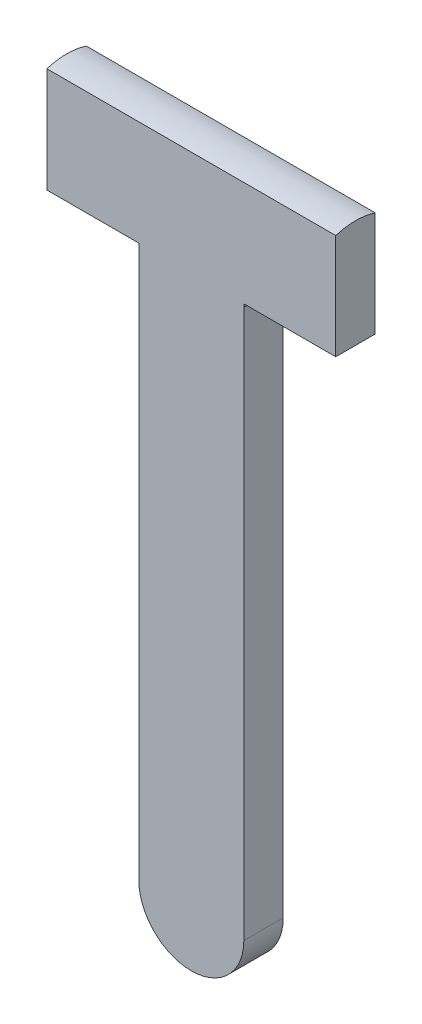
ISO-10303-21;
HEADER;
FILE_DESCRIPTION(('STEP AP214'),'2;1');
FILE_NAME('part.step','',(''),(''),'','','');
FILE_SCHEMA(('AUTOMOTIVE_DESIGN { 1 0 10303 214 1 1 1 1 }'));
ENDSEC;
DATA;
#1=APPLICATION_CONTEXT('core data for automotive mechanical design processes');
#2=APPLICATION_PROTOCOL_DEFINITION('international standard','automotive_design',2000,#1);
#3=PRODUCT_CONTEXT('',#1,'mechanical');
#4=PRODUCT('Part','Part','',(#3));
#5=PRODUCT_RELATED_PRODUCT_CATEGORY('part','',(#4));
#6=PRODUCT_DEFINITION_FORMATION('','',#4);
#7=PRODUCT_DEFINITION_CONTEXT('part definition',#1,'design');
#8=PRODUCT_DEFINITION('design','',#6,#7);
#9=PRODUCT_DEFINITION_SHAPE('','',#8);
#10=(LENGTH_UNIT() NAMED_UNIT(*) SI_UNIT(.MILLI.,.METRE.));
#11=(NAMED_UNIT(*) PLANE_ANGLE_UNIT() SI_UNIT($,.RADIAN.));
#12=(NAMED_UNIT(*) SI_UNIT($,.STERADIAN.) SOLID_ANGLE_UNIT());
#13=UNCERTAINTY_MEASURE_WITH_UNIT(LENGTH_MEASURE(1.E-05),#10,'distance_accuracy_value','');
#14=(GEOMETRIC_REPRESENTATION_CONTEXT(3) GLOBAL_UNCERTAINTY_ASSIGNED_CONTEXT((#13)) GLOBAL_UNIT_ASSIGNED_CONTEXT((#10,
#11,#12)) REPRESENTATION_CONTEXT('',''));
#15=CARTESIAN_POINT('',(0.,0.,0.));
#16=DIRECTION('',(0.,0.,1.));
#17=DIRECTION('',(1.,0.,0.));
#18=AXIS2_PLACEMENT_3D('',#15,#16,#17);
#19=CARTESIAN_POINT('',(2.,-4.,1.5));
#20=DIRECTION('',(0.,1.,0.));
#21=DIRECTION('',(0.,0.,1.));
#22=AXIS2_PLACEMENT_3D('',#19,#20,#21);
#23=PLANE('',#22);
#24=CARTESIAN_POINT('',(0.,-4.,0.75));
#25=DIRECTION('',(0.,-1.,0.));
#26=DIRECTION('',(0.,0.,-1.));
#27=AXIS2_PLACEMENT_3D('',#24,#25,#26);
#28=CIRCLE('',#27,2.13600093632938);
#29=CARTESIAN_POINT('',(2.,-4.,0.));
#30=VERTEX_POINT('',#29);
#31=CARTESIAN_POINT('',(2.,-4.,1.5));
#32=VERTEX_POINT('',#31);
#33=EDGE_CURVE('E137',#30,#32,#28,.T.);
#34=ORIENTED_EDGE('',*,*,#33,.F.);
#35=DIRECTION('',(1.,0.,0.));
#36=VECTOR('',#35,1.);
#37=CARTESIAN_POINT('',(2.,-4.,0.));
#38=LINE('',#37,#36);
#39=CARTESIAN_POINT('',(5.5,-4.,0.));
#40=VERTEX_POINT('',#39);
#41=EDGE_CURVE('E185',#30,#40,#38,.T.);
#42=ORIENTED_EDGE('',*,*,#41,.T.);
#43=DIRECTION('',(0.,0.,-1.));
#44=VECTOR('',#43,1.);
#45=CARTESIAN_POINT('',(5.5,-4.,1.5));
#46=LINE('',#45,#44);
#47=CARTESIAN_POINT('',(5.5,-4.,1.5));
#48=VERTEX_POINT('',#47);
#49=EDGE_CURVE('E174',#48,#40,#46,.T.);
#50=ORIENTED_EDGE('',*,*,#49,.F.);
#51=DIRECTION('',(1.,0.,0.));
#52=VECTOR('',#51,1.);
#53=CARTESIAN_POINT('',(2.,-4.,1.5));
#54=LINE('',#53,#52);
#55=EDGE_CURVE('E169',#32,#48,#54,.T.);
#56=ORIENTED_EDGE('',*,*,#55,.F.);
#57=EDGE_LOOP('',(#34,#42,#50,#56));
#58=FACE_BOUND('',#57,.T.);
#59=ADVANCED_FACE('F33',(#58),#23,.F.);
#60=CARTESIAN_POINT('',(-5.5,-4.,1.5));
#61=DIRECTION('',(0.,1.,0.));
#62=DIRECTION('',(0.,0.,1.));
#63=AXIS2_PLACEMENT_3D('',#60,#61,#62);
#64=PLANE('',#63);
#65=CARTESIAN_POINT('',(0.,-4.,0.75));
#66=DIRECTION('',(0.,-1.,0.));
#67=DIRECTION('',(0.,0.,-1.));
#68=AXIS2_PLACEMENT_3D('',#65,#66,#67);
#69=CIRCLE('',#68,2.13600093632938);
#70=CARTESIAN_POINT('',(-2.,-4.,1.5));
#71=VERTEX_POINT('',#70);
#72=CARTESIAN_POINT('',(-2.,-4.,0.));
#73=VERTEX_POINT('',#72);
#74=EDGE_CURVE('E149',#71,#73,#69,.T.);
#75=ORIENTED_EDGE('',*,*,#74,.F.);
#76=DIRECTION('',(1.,0.,0.));
#77=VECTOR('',#76,1.);
#78=CARTESIAN_POINT('',(-5.5,-4.,1.5));
#79=LINE('',#78,#77);
#80=CARTESIAN_POINT('',(-5.5,-4.,1.5));
#81=VERTEX_POINT('',#80);
#82=EDGE_CURVE('E158',#81,#71,#79,.T.);
#83=ORIENTED_EDGE('',*,*,#82,.F.);
#84=DIRECTION('',(0.,0.,-1.));
#85=VECTOR('',#84,1.);
#86=CARTESIAN_POINT('',(-5.5,-4.,1.5));
#87=LINE('',#86,#85);
#88=CARTESIAN_POINT('',(-5.5,-4.,0.));
#89=VERTEX_POINT('',#88);
#90=EDGE_CURVE('E11',#81,#89,#87,.T.);
#91=ORIENTED_EDGE('',*,*,#90,.T.);
#92=DIRECTION('',(1.,0.,0.));
#93=VECTOR('',#92,1.);
#94=CARTESIAN_POINT('',(-5.5,-4.,0.));
#95=LINE('',#94,#93);
#96=EDGE_CURVE('E118',#89,#73,#95,.T.);
#97=ORIENTED_EDGE('',*,*,#96,.T.);
#98=EDGE_LOOP('',(#75,#83,#91,#97));
#99=FACE_BOUND('',#98,.T.);
#100=ADVANCED_FACE('F219',(#99),#64,.F.);
#101=CARTESIAN_POINT('',(-5.5,0.,1.5));
#102=DIRECTION('',(1.,0.,0.));
#103=DIRECTION('',(0.,0.,-1.));
#104=AXIS2_PLACEMENT_3D('',#101,#102,#103);
#105=PLANE('',#104);
#106=DIRECTION('',(0.,-1.,0.));
#107=VECTOR('',#106,1.);
#108=CARTESIAN_POINT('',(-5.5,0.,0.));
#109=LINE('',#108,#107);
#110=CARTESIAN_POINT('',(-5.5,0.,0.));
#111=VERTEX_POINT('',#110);
#112=EDGE_CURVE('E111',#111,#89,#109,.T.);
#113=ORIENTED_EDGE('',*,*,#112,.T.);
#114=ORIENTED_EDGE('',*,*,#90,.F.);
#115=DIRECTION('',(0.,-1.,0.));
#116=VECTOR('',#115,1.);
#117=CARTESIAN_POINT('',(-5.5,0.,1.5));
#118=LINE('',#117,#116);
#119=CARTESIAN_POINT('',(-5.5,0.,1.5));
#120=VERTEX_POINT('',#119);
#121=EDGE_CURVE('E131',#120,#81,#118,.T.);
#122=ORIENTED_EDGE('',*,*,#121,.F.);
#123=CARTESIAN_POINT('',(-5.5,-2.38484800354236,0.75));
#124=DIRECTION('',(-1.,0.,0.));
#125=DIRECTION('',(0.,0.,1.));
#126=AXIS2_PLACEMENT_3D('',#123,#124,#125);
#127=CIRCLE('',#126,2.5);
#128=EDGE_CURVE('E128',#120,#111,#127,.T.);
#129=ORIENTED_EDGE('',*,*,#128,.T.);
#130=EDGE_LOOP('',(#113,#114,#122,#129));
#131=FACE_BOUND('',#130,.T.);
#132=ADVANCED_FACE('F35',(#131),#105,.F.);
#133=CARTESIAN_POINT('',(-2.,-4.,1.5));
#134=DIRECTION('',(1.,0.,0.));
#135=DIRECTION('',(0.,1.,0.));
#136=AXIS2_PLACEMENT_3D('',#133,#134,#135);
#137=PLANE('',#136);
#138=DIRECTION('',(0.,-1.,0.));
#139=VECTOR('',#138,1.);
#140=CARTESIAN_POINT('',(-2.,-4.,1.5));
#141=LINE('',#140,#139);
#142=CARTESIAN_POINT('',(-2.,-4.1,1.5));
#143=VERTEX_POINT('',#142);
#144=CARTESIAN_POINT('',(-2.,-25.,1.5));
#145=VERTEX_POINT('',#144);
#146=EDGE_CURVE('E161',#143,#145,#141,.T.);
#147=ORIENTED_EDGE('',*,*,#146,.F.);
#148=DIRECTION('',(0.,0.,1.));
#149=VECTOR('',#148,1.);
#150=CARTESIAN_POINT('',(-2.,-4.1,1.5));
#151=LINE('',#150,#149);
#152=CARTESIAN_POINT('',(-2.,-4.1,0.));
#153=VERTEX_POINT('',#152);
#154=EDGE_CURVE('E122',#153,#143,#151,.T.);
#155=ORIENTED_EDGE('',*,*,#154,.F.);
#156=DIRECTION('',(0.,-1.,0.));
#157=VECTOR('',#156,1.);
#158=CARTESIAN_POINT('',(-2.,-4.,0.));
#159=LINE('',#158,#157);
#160=CARTESIAN_POINT('',(-2.,-25.,0.));
#161=VERTEX_POINT('',#160);
#162=EDGE_CURVE('E177',#153,#161,#159,.T.);
#163=ORIENTED_EDGE('',*,*,#162,.T.);
#164=DIRECTION('',(0.,0.,-1.));
#165=VECTOR('',#164,1.);
#166=CARTESIAN_POINT('',(-2.,-25.,1.5));
#167=LINE('',#166,#165);
#168=EDGE_CURVE('E41',#145,#161,#167,.T.);
#169=ORIENTED_EDGE('',*,*,#168,.F.);
#170=EDGE_LOOP('',(#147,#155,#163,#169));
#171=FACE_BOUND('',#170,.T.);
#172=ADVANCED_FACE('F225',(#171),#137,.F.);
#173=CARTESIAN_POINT('',(0.,-25.,1.5));
#174=DIRECTION('',(0.,0.,-1.));
#175=DIRECTION('',(-1.,0.,0.));
#176=AXIS2_PLACEMENT_3D('',#173,#174,#175);
#177=CYLINDRICAL_SURFACE('',#176,2.);
#178=CARTESIAN_POINT('',(0.,-25.,0.));
#179=DIRECTION('',(0.,0.,1.));
#180=DIRECTION('',(1.,0.,0.));
#181=AXIS2_PLACEMENT_3D('',#178,#179,#180);
#182=CIRCLE('',#181,2.);
#183=CARTESIAN_POINT('',(2.,-25.,0.));
#184=VERTEX_POINT('',#183);
#185=EDGE_CURVE('E181',#161,#184,#182,.T.);
#186=ORIENTED_EDGE('',*,*,#185,.T.);
#187=DIRECTION('',(0.,0.,-1.));
#188=VECTOR('',#187,1.);
#189=CARTESIAN_POINT('',(2.,-25.,1.5));
#190=LINE('',#189,#188);
#191=CARTESIAN_POINT('',(2.,-25.,1.5));
#192=VERTEX_POINT('',#191);
#193=EDGE_CURVE('E190',#192,#184,#190,.T.);
#194=ORIENTED_EDGE('',*,*,#193,.F.);
#195=CARTESIAN_POINT('',(0.,-25.,1.5));
#196=DIRECTION('',(0.,0.,1.));
#197=DIRECTION('',(1.,0.,0.));
#198=AXIS2_PLACEMENT_3D('',#195,#196,#197);
#199=CIRCLE('',#198,2.);
#200=EDGE_CURVE('E165',#145,#192,#199,.T.);
#201=ORIENTED_EDGE('',*,*,#200,.F.);
#202=ORIENTED_EDGE('',*,*,#168,.T.);
#203=EDGE_LOOP('',(#186,#194,#201,#202));
#204=FACE_BOUND('',#203,.T.);
#205=ADVANCED_FACE('F197',(#204),#177,.T.);
#206=CARTESIAN_POINT('',(2.,-4.,1.5));
#207=DIRECTION('',(-1.,0.,0.));
#208=DIRECTION('',(0.,-1.,0.));
#209=AXIS2_PLACEMENT_3D('',#206,#207,#208);
#210=PLANE('',#209);
#211=DIRECTION('',(0.,1.,0.));
#212=VECTOR('',#211,1.);
#213=CARTESIAN_POINT('',(2.,-4.,0.));
#214=LINE('',#213,#212);
#215=CARTESIAN_POINT('',(2.,-4.1,0.));
#216=VERTEX_POINT('',#215);
#217=EDGE_CURVE('E183',#184,#216,#214,.T.);
#218=ORIENTED_EDGE('',*,*,#217,.T.);
#219=DIRECTION('',(0.,0.,-1.));
#220=VECTOR('',#219,1.);
#221=CARTESIAN_POINT('',(2.,-4.1,1.5));
#222=LINE('',#221,#220);
#223=CARTESIAN_POINT('',(2.,-4.1,1.5));
#224=VERTEX_POINT('',#223);
#225=EDGE_CURVE('E48',#224,#216,#222,.T.);
#226=ORIENTED_EDGE('',*,*,#225,.F.);
#227=DIRECTION('',(0.,1.,0.));
#228=VECTOR('',#227,1.);
#229=CARTESIAN_POINT('',(2.,-4.,1.5));
#230=LINE('',#229,#228);
#231=EDGE_CURVE('E167',#192,#224,#230,.T.);
#232=ORIENTED_EDGE('',*,*,#231,.F.);
#233=ORIENTED_EDGE('',*,*,#193,.T.);
#234=EDGE_LOOP('',(#218,#226,#232,#233));
#235=FACE_BOUND('',#234,.T.);
#236=ADVANCED_FACE('F201',(#235),#210,.F.);
#237=CARTESIAN_POINT('',(5.5,-4.,1.5));
#238=DIRECTION('',(-1.,0.,0.));
#239=DIRECTION('',(0.,-1.,0.));
#240=AXIS2_PLACEMENT_3D('',#237,#238,#239);
#241=PLANE('',#240);
#242=DIRECTION('',(0.,1.,0.));
#243=VECTOR('',#242,1.);
#244=CARTESIAN_POINT('',(5.5,-4.,0.));
#245=LINE('',#244,#243);
#246=CARTESIAN_POINT('',(5.5,0.,0.));
#247=VERTEX_POINT('',#246);
#248=EDGE_CURVE('E132',#40,#247,#245,.T.);
#249=ORIENTED_EDGE('',*,*,#248,.T.);
#250=CARTESIAN_POINT('',(5.5,-2.38484800354236,0.75));
#251=DIRECTION('',(-1.,0.,0.));
#252=DIRECTION('',(0.,-1.,0.));
#253=AXIS2_PLACEMENT_3D('',#250,#251,#252);
#254=CIRCLE('',#253,2.5);
#255=CARTESIAN_POINT('',(5.5,0.,1.5));
#256=VERTEX_POINT('',#255);
#257=EDGE_CURVE('E130',#247,#256,#254,.F.);
#258=ORIENTED_EDGE('',*,*,#257,.T.);
#259=DIRECTION('',(0.,1.,0.));
#260=VECTOR('',#259,1.);
#261=CARTESIAN_POINT('',(5.5,-4.,1.5));
#262=LINE('',#261,#260);
#263=EDGE_CURVE('E171',#48,#256,#262,.T.);
#264=ORIENTED_EDGE('',*,*,#263,.F.);
#265=ORIENTED_EDGE('',*,*,#49,.T.);
#266=EDGE_LOOP('',(#249,#258,#264,#265));
#267=FACE_BOUND('',#266,.T.);
#268=ADVANCED_FACE('F216',(#267),#241,.F.);
#269=CARTESIAN_POINT('',(0.,-25.,1.5));
#270=DIRECTION('',(0.,0.,1.));
#271=DIRECTION('',(1.,0.,0.));
#272=AXIS2_PLACEMENT_3D('',#269,#270,#271);
#273=PLANE('',#272);
#274=ORIENTED_EDGE('',*,*,#121,.T.);
#275=ORIENTED_EDGE('',*,*,#82,.T.);
#276=EDGE_CURVE('E162',#71,#143,#141,.T.);
#277=ORIENTED_EDGE('',*,*,#276,.T.);
#278=ORIENTED_EDGE('',*,*,#146,.T.);
#279=ORIENTED_EDGE('',*,*,#200,.T.);
#280=ORIENTED_EDGE('',*,*,#231,.T.);
#281=DIRECTION('',(0.,1.,0.));
#282=VECTOR('',#281,1.);
#283=CARTESIAN_POINT('',(2.,-4.1,1.5));
#284=LINE('',#283,#282);
#285=EDGE_CURVE('E147',#224,#32,#284,.T.);
#286=ORIENTED_EDGE('',*,*,#285,.T.);
#287=ORIENTED_EDGE('',*,*,#55,.T.);
#288=ORIENTED_EDGE('',*,*,#263,.T.);
#289=DIRECTION('',(-1.,0.,0.));
#290=VECTOR('',#289,1.);
#291=CARTESIAN_POINT('',(-5.5,0.,1.5));
#292=LINE('',#291,#290);
#293=EDGE_CURVE('E173',#256,#120,#292,.T.);
#294=ORIENTED_EDGE('',*,*,#293,.T.);
#295=EDGE_LOOP('',(#274,#275,#277,#278,#279,#280,#286,#287,#288,#294));
#296=FACE_BOUND('',#295,.T.);
#297=ADVANCED_FACE('F211',(#296),#273,.T.);
#298=CARTESIAN_POINT('',(0.,-25.,0.));
#299=DIRECTION('',(0.,0.,1.));
#300=DIRECTION('',(1.,0.,0.));
#301=AXIS2_PLACEMENT_3D('',#298,#299,#300);
#302=PLANE('',#301);
#303=ORIENTED_EDGE('',*,*,#112,.F.);
#304=DIRECTION('',(-1.,0.,0.));
#305=VECTOR('',#304,1.);
#306=CARTESIAN_POINT('',(-5.5,0.,0.));
#307=LINE('',#306,#305);
#308=EDGE_CURVE('E115',#247,#111,#307,.T.);
#309=ORIENTED_EDGE('',*,*,#308,.F.);
#310=ORIENTED_EDGE('',*,*,#248,.F.);
#311=ORIENTED_EDGE('',*,*,#41,.F.);
#312=DIRECTION('',(0.,1.,0.));
#313=VECTOR('',#312,1.);
#314=CARTESIAN_POINT('',(2.,-4.1,0.));
#315=LINE('',#314,#313);
#316=EDGE_CURVE('E56',#216,#30,#315,.T.);
#317=ORIENTED_EDGE('',*,*,#316,.F.);
#318=ORIENTED_EDGE('',*,*,#217,.F.);
#319=ORIENTED_EDGE('',*,*,#185,.F.);
#320=ORIENTED_EDGE('',*,*,#162,.F.);
#321=EDGE_CURVE('E178',#73,#153,#159,.T.);
#322=ORIENTED_EDGE('',*,*,#321,.F.);
#323=ORIENTED_EDGE('',*,*,#96,.F.);
#324=EDGE_LOOP('',(#303,#309,#310,#311,#317,#318,#319,#320,#322,#323));
#325=FACE_BOUND('',#324,.T.);
#326=ADVANCED_FACE('F113',(#325),#302,.F.);
#327=CARTESIAN_POINT('',(0.,-4.1,0.75));
#328=DIRECTION('',(0.,1.,0.));
#329=DIRECTION('',(0.,0.,1.));
#330=AXIS2_PLACEMENT_3D('',#327,#328,#329);
#331=CYLINDRICAL_SURFACE('',#330,2.13600093632938);
#332=ORIENTED_EDGE('',*,*,#74,.T.);
#333=ORIENTED_EDGE('',*,*,#321,.T.);
#334=CARTESIAN_POINT('',(0.,-4.1,0.75));
#335=DIRECTION('',(0.,-1.,0.));
#336=DIRECTION('',(0.,0.,-1.));
#337=AXIS2_PLACEMENT_3D('',#334,#335,#336);
#338=CIRCLE('',#337,2.13600093632938);
#339=EDGE_CURVE('E150',#143,#153,#338,.T.);
#340=ORIENTED_EDGE('',*,*,#339,.F.);
#341=ORIENTED_EDGE('',*,*,#276,.F.);
#342=EDGE_LOOP('',(#332,#333,#340,#341));
#343=FACE_BOUND('',#342,.T.);
#344=ADVANCED_FACE('F221',(#343),#331,.T.);
#345=CARTESIAN_POINT('',(0.,-4.1,0.75));
#346=DIRECTION('',(0.,-1.,0.));
#347=DIRECTION('',(0.,0.,-1.));
#348=AXIS2_PLACEMENT_3D('',#345,#346,#347);
#349=PLANE('',#348);
#350=ORIENTED_EDGE('',*,*,#339,.T.);
#351=ORIENTED_EDGE('',*,*,#154,.T.);
#352=EDGE_LOOP('',(#350,#351));
#353=FACE_BOUND('',#352,.T.);
#354=ADVANCED_FACE('F224',(#353),#349,.T.);
#355=CARTESIAN_POINT('',(0.,-4.1,0.75));
#356=DIRECTION('',(0.,1.,0.));
#357=DIRECTION('',(0.,0.,1.));
#358=AXIS2_PLACEMENT_3D('',#355,#356,#357);
#359=CYLINDRICAL_SURFACE('',#358,2.13600093632938);
#360=ORIENTED_EDGE('',*,*,#33,.T.);
#361=ORIENTED_EDGE('',*,*,#285,.F.);
#362=CARTESIAN_POINT('',(0.,-4.1,0.75));
#363=DIRECTION('',(0.,-1.,0.));
#364=DIRECTION('',(0.,0.,-1.));
#365=AXIS2_PLACEMENT_3D('',#362,#363,#364);
#366=CIRCLE('',#365,2.13600093632938);
#367=EDGE_CURVE('E140',#216,#224,#366,.T.);
#368=ORIENTED_EDGE('',*,*,#367,.F.);
#369=ORIENTED_EDGE('',*,*,#316,.T.);
#370=EDGE_LOOP('',(#360,#361,#368,#369));
#371=FACE_BOUND('',#370,.T.);
#372=ADVANCED_FACE('F207',(#371),#359,.T.);
#373=CARTESIAN_POINT('',(0.,-4.1,0.75));
#374=DIRECTION('',(0.,-1.,0.));
#375=DIRECTION('',(0.,0.,-1.));
#376=AXIS2_PLACEMENT_3D('',#373,#374,#375);
#377=PLANE('',#376);
#378=ORIENTED_EDGE('',*,*,#367,.T.);
#379=ORIENTED_EDGE('',*,*,#225,.T.);
#380=EDGE_LOOP('',(#378,#379));
#381=FACE_BOUND('',#380,.T.);
#382=ADVANCED_FACE('F204',(#381),#377,.T.);
#383=CARTESIAN_POINT('',(7.00441350109874,-2.38484800354236,0.75));
#384=DIRECTION('',(-1.,0.,0.));
#385=DIRECTION('',(0.,0.,1.));
#386=AXIS2_PLACEMENT_3D('',#383,#384,#385);
#387=CYLINDRICAL_SURFACE('',#386,2.5);
#388=ORIENTED_EDGE('',*,*,#257,.F.);
#389=ORIENTED_EDGE('',*,*,#308,.T.);
#390=ORIENTED_EDGE('',*,*,#128,.F.);
#391=ORIENTED_EDGE('',*,*,#293,.F.);
#392=EDGE_LOOP('',(#388,#389,#390,#391));
#393=FACE_BOUND('',#392,.T.);
#394=ADVANCED_FACE('F126',(#393),#387,.T.);
#395=CLOSED_SHELL('',(#59,#100,#132,#172,#205,#236,#268,#297,#326,#344,#354,#372,#382,#394));
#396=MANIFOLD_SOLID_BREP('B2',#395);
#397=ADVANCED_BREP_SHAPE_REPRESENTATION('',(#18,#396),#14);
#398=SHAPE_DEFINITION_REPRESENTATION(#9,#397);
ENDSEC;
END-ISO-10303-21;
